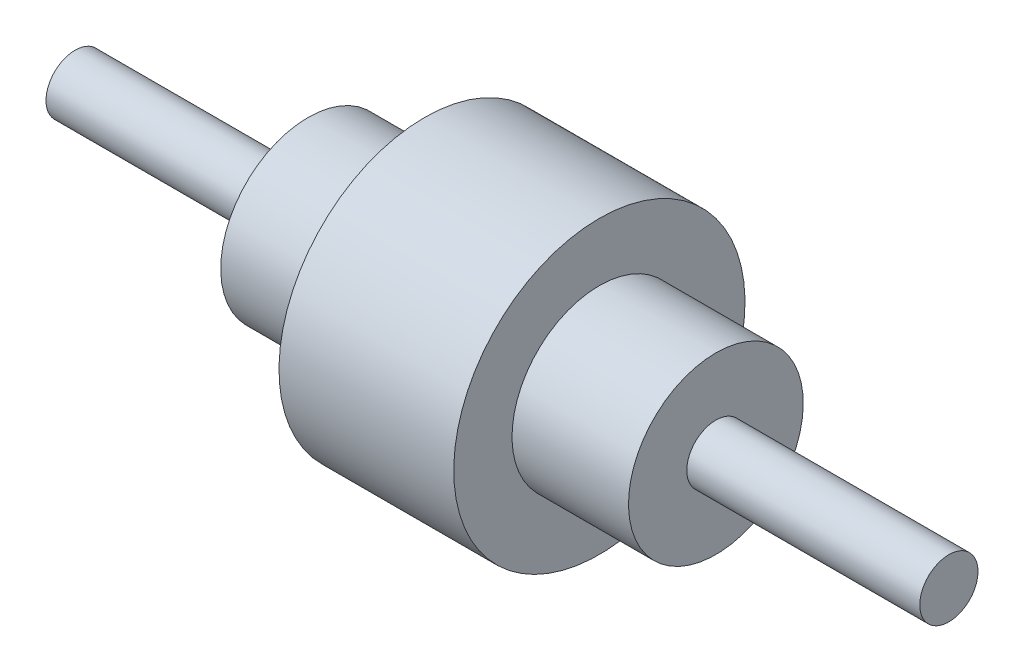
ISO-10303-21;
HEADER;
FILE_DESCRIPTION(('STEP AP214'),'2;1');
FILE_NAME('part.step','',(''),(''),'','','');
FILE_SCHEMA(('AUTOMOTIVE_DESIGN { 1 0 10303 214 1 1 1 1 }'));
ENDSEC;
DATA;
#1=APPLICATION_CONTEXT('core data for automotive mechanical design processes');
#2=APPLICATION_PROTOCOL_DEFINITION('international standard','automotive_design',2000,#1);
#3=PRODUCT_CONTEXT('',#1,'mechanical');
#4=PRODUCT('Part','Part','',(#3));
#5=PRODUCT_RELATED_PRODUCT_CATEGORY('part','',(#4));
#6=PRODUCT_DEFINITION_FORMATION('','',#4);
#7=PRODUCT_DEFINITION_CONTEXT('part definition',#1,'design');
#8=PRODUCT_DEFINITION('design','',#6,#7);
#9=PRODUCT_DEFINITION_SHAPE('','',#8);
#10=(LENGTH_UNIT() NAMED_UNIT(*) SI_UNIT(.MILLI.,.METRE.));
#11=(NAMED_UNIT(*) PLANE_ANGLE_UNIT() SI_UNIT($,.RADIAN.));
#12=(NAMED_UNIT(*) SI_UNIT($,.STERADIAN.) SOLID_ANGLE_UNIT());
#13=UNCERTAINTY_MEASURE_WITH_UNIT(LENGTH_MEASURE(1.E-05),#10,'distance_accuracy_value','');
#14=(GEOMETRIC_REPRESENTATION_CONTEXT(3) GLOBAL_UNCERTAINTY_ASSIGNED_CONTEXT((#13)) GLOBAL_UNIT_ASSIGNED_CONTEXT((#10,
#11,#12)) REPRESENTATION_CONTEXT('',''));
#15=CARTESIAN_POINT('',(0.,0.,0.));
#16=DIRECTION('',(0.,0.,1.));
#17=DIRECTION('',(1.,0.,0.));
#18=AXIS2_PLACEMENT_3D('',#15,#16,#17);
#19=CARTESIAN_POINT('',(0.,0.,0.));
#20=DIRECTION('',(-1.,0.,0.));
#21=DIRECTION('',(0.,-1.,0.));
#22=AXIS2_PLACEMENT_3D('',#19,#20,#21);
#23=PLANE('',#22);
#24=CARTESIAN_POINT('',(0.,0.,0.));
#25=DIRECTION('',(1.,0.,0.));
#26=DIRECTION('',(0.,1.,0.));
#27=AXIS2_PLACEMENT_3D('',#24,#25,#26);
#28=CIRCLE('',#27,254.000000000001);
#29=CARTESIAN_POINT('',(0.,254.000000000001,0.));
#30=VERTEX_POINT('',#29);
#31=EDGE_CURVE('E10',#30,#30,#28,.T.);
#32=ORIENTED_EDGE('',*,*,#31,.T.);
#33=EDGE_LOOP('',(#32));
#34=FACE_BOUND('',#33,.T.);
#35=ADVANCED_FACE('F31',(#34),#23,.F.);
#36=CARTESIAN_POINT('',(0.,0.,0.));
#37=DIRECTION('',(1.,0.,0.));
#38=DIRECTION('',(0.,1.,0.));
#39=AXIS2_PLACEMENT_3D('',#36,#37,#38);
#40=CYLINDRICAL_SURFACE('',#39,254.000000000001);
#41=ORIENTED_EDGE('',*,*,#31,.F.);
#42=EDGE_LOOP('',(#41));
#43=FACE_BOUND('',#42,.T.);
#44=CARTESIAN_POINT('',(-2032.,-2.25664096903846E-13,0.));
#45=DIRECTION('',(1.,0.,0.));
#46=DIRECTION('',(0.,1.,0.));
#47=AXIS2_PLACEMENT_3D('',#44,#45,#46);
#48=CIRCLE('',#47,254.000000000001);
#49=CARTESIAN_POINT('',(-2032.,254.000000000001,0.));
#50=VERTEX_POINT('',#49);
#51=EDGE_CURVE('E37',#50,#50,#48,.T.);
#52=ORIENTED_EDGE('',*,*,#51,.T.);
#53=EDGE_LOOP('',(#52));
#54=FACE_BOUND('',#53,.T.);
#55=ADVANCED_FACE('F81',(#43,#54),#40,.T.);
#56=CARTESIAN_POINT('',(-2032.,-254.000000000001,0.));
#57=DIRECTION('',(-1.,0.,0.));
#58=DIRECTION('',(0.,-1.,0.));
#59=AXIS2_PLACEMENT_3D('',#56,#57,#58);
#60=PLANE('',#59);
#61=ORIENTED_EDGE('',*,*,#51,.F.);
#62=EDGE_LOOP('',(#61));
#63=FACE_BOUND('',#62,.T.);
#64=CARTESIAN_POINT('',(-2032.,-2.25664096903846E-13,0.));
#65=DIRECTION('',(1.,0.,0.));
#66=DIRECTION('',(0.,1.,0.));
#67=AXIS2_PLACEMENT_3D('',#64,#65,#66);
#68=CIRCLE('',#67,762.000000000001);
#69=CARTESIAN_POINT('',(-2032.,762.,0.));
#70=VERTEX_POINT('',#69);
#71=EDGE_CURVE('E41',#70,#70,#68,.T.);
#72=ORIENTED_EDGE('',*,*,#71,.T.);
#73=EDGE_LOOP('',(#72));
#74=FACE_BOUND('',#73,.T.);
#75=ADVANCED_FACE('F85',(#63,#74),#60,.F.);
#76=CARTESIAN_POINT('',(0.,0.,0.));
#77=DIRECTION('',(1.,0.,0.));
#78=DIRECTION('',(0.,1.,0.));
#79=AXIS2_PLACEMENT_3D('',#76,#77,#78);
#80=CYLINDRICAL_SURFACE('',#79,762.);
#81=ORIENTED_EDGE('',*,*,#71,.F.);
#82=EDGE_LOOP('',(#81));
#83=FACE_BOUND('',#82,.T.);
#84=CARTESIAN_POINT('',(-3048.,-3.38496145355769E-13,0.));
#85=DIRECTION('',(1.,0.,0.));
#86=DIRECTION('',(0.,1.,0.));
#87=AXIS2_PLACEMENT_3D('',#84,#85,#86);
#88=CIRCLE('',#87,762.);
#89=CARTESIAN_POINT('',(-3048.,762.,0.));
#90=VERTEX_POINT('',#89);
#91=EDGE_CURVE('E45',#90,#90,#88,.T.);
#92=ORIENTED_EDGE('',*,*,#91,.T.);
#93=EDGE_LOOP('',(#92));
#94=FACE_BOUND('',#93,.T.);
#95=ADVANCED_FACE('F90',(#83,#94),#80,.T.);
#96=CARTESIAN_POINT('',(-3048.,-762.000000000001,0.));
#97=DIRECTION('',(-1.,0.,0.));
#98=DIRECTION('',(0.,-1.,0.));
#99=AXIS2_PLACEMENT_3D('',#96,#97,#98);
#100=PLANE('',#99);
#101=ORIENTED_EDGE('',*,*,#91,.F.);
#102=EDGE_LOOP('',(#101));
#103=FACE_BOUND('',#102,.T.);
#104=CARTESIAN_POINT('',(-3048.,-3.38496145355769E-13,0.));
#105=DIRECTION('',(1.,0.,0.));
#106=DIRECTION('',(0.,1.,0.));
#107=AXIS2_PLACEMENT_3D('',#104,#105,#106);
#108=CIRCLE('',#107,1270.);
#109=CARTESIAN_POINT('',(-3048.,1270.,0.));
#110=VERTEX_POINT('',#109);
#111=EDGE_CURVE('E50',#110,#110,#108,.T.);
#112=ORIENTED_EDGE('',*,*,#111,.T.);
#113=EDGE_LOOP('',(#112));
#114=FACE_BOUND('',#113,.T.);
#115=ADVANCED_FACE('F96',(#103,#114),#100,.F.);
#116=CARTESIAN_POINT('',(0.,0.,0.));
#117=DIRECTION('',(1.,0.,0.));
#118=DIRECTION('',(0.,1.,0.));
#119=AXIS2_PLACEMENT_3D('',#116,#117,#118);
#120=CYLINDRICAL_SURFACE('',#119,1270.);
#121=ORIENTED_EDGE('',*,*,#111,.F.);
#122=EDGE_LOOP('',(#121));
#123=FACE_BOUND('',#122,.T.);
#124=CARTESIAN_POINT('',(-4572.,-5.07744218033653E-13,0.));
#125=DIRECTION('',(1.,0.,0.));
#126=DIRECTION('',(0.,1.,0.));
#127=AXIS2_PLACEMENT_3D('',#124,#125,#126);
#128=CIRCLE('',#127,1270.);
#129=CARTESIAN_POINT('',(-4572.,1270.,0.));
#130=VERTEX_POINT('',#129);
#131=EDGE_CURVE('E53',#130,#130,#128,.T.);
#132=ORIENTED_EDGE('',*,*,#131,.T.);
#133=EDGE_LOOP('',(#132));
#134=FACE_BOUND('',#133,.T.);
#135=ADVANCED_FACE('F100',(#123,#134),#120,.T.);
#136=CARTESIAN_POINT('',(-4572.,-762.000000000001,0.));
#137=DIRECTION('',(1.,0.,0.));
#138=DIRECTION('',(0.,1.,0.));
#139=AXIS2_PLACEMENT_3D('',#136,#137,#138);
#140=PLANE('',#139);
#141=ORIENTED_EDGE('',*,*,#131,.F.);
#142=EDGE_LOOP('',(#141));
#143=FACE_BOUND('',#142,.T.);
#144=CARTESIAN_POINT('',(-4572.,-5.07744218033653E-13,0.));
#145=DIRECTION('',(1.,0.,0.));
#146=DIRECTION('',(0.,1.,0.));
#147=AXIS2_PLACEMENT_3D('',#144,#145,#146);
#148=CIRCLE('',#147,762.);
#149=CARTESIAN_POINT('',(-4572.,762.,0.));
#150=VERTEX_POINT('',#149);
#151=EDGE_CURVE('E56',#150,#150,#148,.T.);
#152=ORIENTED_EDGE('',*,*,#151,.T.);
#153=EDGE_LOOP('',(#152));
#154=FACE_BOUND('',#153,.T.);
#155=ADVANCED_FACE('F104',(#143,#154),#140,.F.);
#156=CARTESIAN_POINT('',(0.,0.,0.));
#157=DIRECTION('',(1.,0.,0.));
#158=DIRECTION('',(0.,1.,0.));
#159=AXIS2_PLACEMENT_3D('',#156,#157,#158);
#160=CYLINDRICAL_SURFACE('',#159,762.);
#161=ORIENTED_EDGE('',*,*,#151,.F.);
#162=EDGE_LOOP('',(#161));
#163=FACE_BOUND('',#162,.T.);
#164=CARTESIAN_POINT('',(-5588.,-6.20576266485576E-13,0.));
#165=DIRECTION('',(1.,0.,0.));
#166=DIRECTION('',(0.,1.,0.));
#167=AXIS2_PLACEMENT_3D('',#164,#165,#166);
#168=CIRCLE('',#167,762.);
#169=CARTESIAN_POINT('',(-5588.,761.999999999999,0.));
#170=VERTEX_POINT('',#169);
#171=EDGE_CURVE('E59',#170,#170,#168,.T.);
#172=ORIENTED_EDGE('',*,*,#171,.T.);
#173=EDGE_LOOP('',(#172));
#174=FACE_BOUND('',#173,.T.);
#175=ADVANCED_FACE('F108',(#163,#174),#160,.T.);
#176=CARTESIAN_POINT('',(-5588.,-254.000000000001,0.));
#177=DIRECTION('',(1.,0.,0.));
#178=DIRECTION('',(0.,1.,0.));
#179=AXIS2_PLACEMENT_3D('',#176,#177,#178);
#180=PLANE('',#179);
#181=ORIENTED_EDGE('',*,*,#171,.F.);
#182=EDGE_LOOP('',(#181));
#183=FACE_BOUND('',#182,.T.);
#184=CARTESIAN_POINT('',(-5588.,-6.20576266485576E-13,0.));
#185=DIRECTION('',(1.,0.,0.));
#186=DIRECTION('',(0.,1.,0.));
#187=AXIS2_PLACEMENT_3D('',#184,#185,#186);
#188=CIRCLE('',#187,254.);
#189=CARTESIAN_POINT('',(-5588.,254.,0.));
#190=VERTEX_POINT('',#189);
#191=EDGE_CURVE('E62',#190,#190,#188,.T.);
#192=ORIENTED_EDGE('',*,*,#191,.T.);
#193=EDGE_LOOP('',(#192));
#194=FACE_BOUND('',#193,.T.);
#195=ADVANCED_FACE('F77',(#183,#194),#180,.F.);
#196=CARTESIAN_POINT('',(0.,0.,0.));
#197=DIRECTION('',(1.,0.,0.));
#198=DIRECTION('',(0.,1.,0.));
#199=AXIS2_PLACEMENT_3D('',#196,#197,#198);
#200=CYLINDRICAL_SURFACE('',#199,254.);
#201=ORIENTED_EDGE('',*,*,#191,.F.);
#202=EDGE_LOOP('',(#201));
#203=FACE_BOUND('',#202,.T.);
#204=CARTESIAN_POINT('',(-7620.,-8.46240363389422E-13,0.));
#205=DIRECTION('',(1.,0.,0.));
#206=DIRECTION('',(0.,1.,0.));
#207=AXIS2_PLACEMENT_3D('',#204,#205,#206);
#208=CIRCLE('',#207,254.);
#209=CARTESIAN_POINT('',(-7620.,253.999999999999,0.));
#210=VERTEX_POINT('',#209);
#211=EDGE_CURVE('E65',#210,#210,#208,.T.);
#212=ORIENTED_EDGE('',*,*,#211,.T.);
#213=EDGE_LOOP('',(#212));
#214=FACE_BOUND('',#213,.T.);
#215=ADVANCED_FACE('F69',(#203,#214),#200,.T.);
#216=CARTESIAN_POINT('',(-7620.,-9.25301502086029E-13,0.));
#217=DIRECTION('',(1.,0.,0.));
#218=DIRECTION('',(0.,1.,0.));
#219=AXIS2_PLACEMENT_3D('',#216,#217,#218);
#220=PLANE('',#219);
#221=ORIENTED_EDGE('',*,*,#211,.F.);
#222=EDGE_LOOP('',(#221));
#223=FACE_BOUND('',#222,.T.);
#224=ADVANCED_FACE('F71',(#223),#220,.F.);
#225=CLOSED_SHELL('',(#35,#55,#75,#95,#115,#135,#155,#175,#195,#215,#224));
#226=MANIFOLD_SOLID_BREP('B2',#225);
#227=ADVANCED_BREP_SHAPE_REPRESENTATION('',(#18,#226),#14);
#228=SHAPE_DEFINITION_REPRESENTATION(#9,#227);
ENDSEC;
END-ISO-10303-21;
